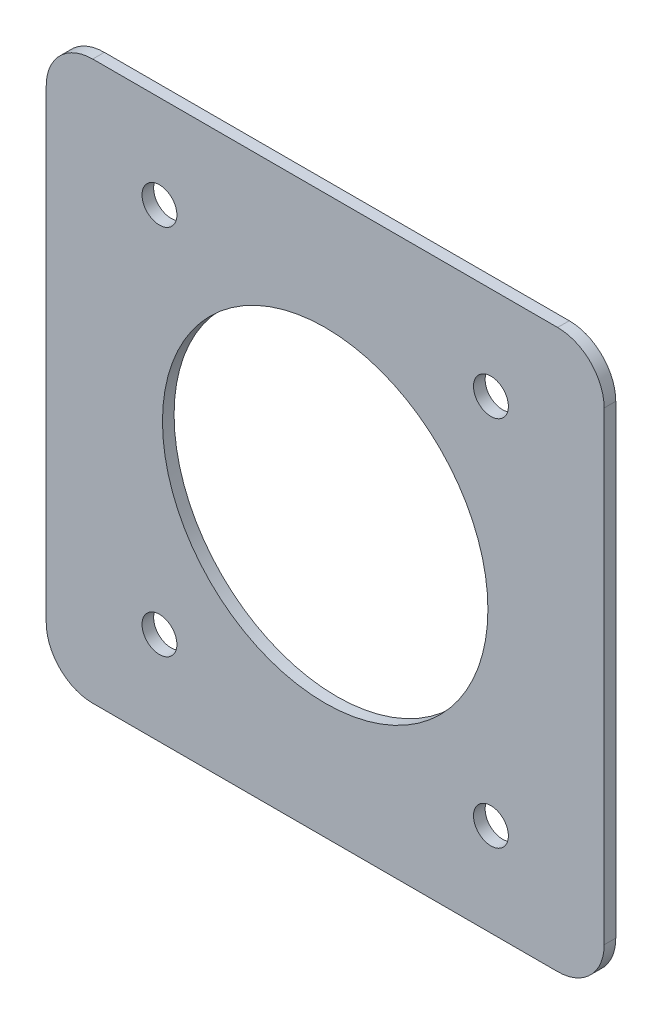
ISO-10303-21;
HEADER;
FILE_DESCRIPTION(('STEP AP214'),'2;1');
FILE_NAME('part.step','',(''),(''),'','','');
FILE_SCHEMA(('AUTOMOTIVE_DESIGN { 1 0 10303 214 1 1 1 1 }'));
ENDSEC;
DATA;
#1=APPLICATION_CONTEXT('core data for automotive mechanical design processes');
#2=APPLICATION_PROTOCOL_DEFINITION('international standard','automotive_design',2000,#1);
#3=PRODUCT_CONTEXT('',#1,'mechanical');
#4=PRODUCT('Part','Part','',(#3));
#5=PRODUCT_RELATED_PRODUCT_CATEGORY('part','',(#4));
#6=PRODUCT_DEFINITION_FORMATION('','',#4);
#7=PRODUCT_DEFINITION_CONTEXT('part definition',#1,'design');
#8=PRODUCT_DEFINITION('design','',#6,#7);
#9=PRODUCT_DEFINITION_SHAPE('','',#8);
#10=(LENGTH_UNIT() NAMED_UNIT(*) SI_UNIT(.MILLI.,.METRE.));
#11=(NAMED_UNIT(*) PLANE_ANGLE_UNIT() SI_UNIT($,.RADIAN.));
#12=(NAMED_UNIT(*) SI_UNIT($,.STERADIAN.) SOLID_ANGLE_UNIT());
#13=UNCERTAINTY_MEASURE_WITH_UNIT(LENGTH_MEASURE(1.E-05),#10,'distance_accuracy_value','');
#14=(GEOMETRIC_REPRESENTATION_CONTEXT(3) GLOBAL_UNCERTAINTY_ASSIGNED_CONTEXT((#13)) GLOBAL_UNIT_ASSIGNED_CONTEXT((#10,
#11,#12)) REPRESENTATION_CONTEXT('',''));
#15=CARTESIAN_POINT('',(0.,0.,0.));
#16=DIRECTION('',(0.,0.,1.));
#17=DIRECTION('',(1.,0.,0.));
#18=AXIS2_PLACEMENT_3D('',#15,#16,#17);
#19=CARTESIAN_POINT('',(-103.997719315894,137.785716341258,3.175));
#20=DIRECTION('',(0.,0.,-1.));
#21=DIRECTION('',(-1.,0.,0.));
#22=AXIS2_PLACEMENT_3D('',#19,#20,#21);
#23=CYLINDRICAL_SURFACE('',#22,12.7);
#24=CARTESIAN_POINT('',(-103.997719315894,137.785716341258,0.));
#25=DIRECTION('',(0.,0.,1.));
#26=DIRECTION('',(1.,0.,0.));
#27=AXIS2_PLACEMENT_3D('',#24,#25,#26);
#28=CIRCLE('',#27,12.7);
#29=CARTESIAN_POINT('',(-103.997719315894,150.485716341258,0.));
#30=VERTEX_POINT('',#29);
#31=CARTESIAN_POINT('',(-91.2977193158941,137.785716341258,0.));
#32=VERTEX_POINT('',#31);
#33=EDGE_CURVE('E141',#30,#32,#28,.F.);
#34=ORIENTED_EDGE('',*,*,#33,.F.);
#35=DIRECTION('',(0.,0.,-1.));
#36=VECTOR('',#35,1.);
#37=CARTESIAN_POINT('',(-103.997719315894,150.485716341258,3.175));
#38=LINE('',#37,#36);
#39=CARTESIAN_POINT('',(-103.997719315894,150.485716341258,3.175));
#40=VERTEX_POINT('',#39);
#41=EDGE_CURVE('E11',#40,#30,#38,.T.);
#42=ORIENTED_EDGE('',*,*,#41,.F.);
#43=CARTESIAN_POINT('',(-103.997719315894,137.785716341258,3.175));
#44=DIRECTION('',(0.,0.,1.));
#45=DIRECTION('',(1.,0.,0.));
#46=AXIS2_PLACEMENT_3D('',#43,#44,#45);
#47=CIRCLE('',#46,12.7);
#48=CARTESIAN_POINT('',(-91.2977193158941,137.785716341258,3.175));
#49=VERTEX_POINT('',#48);
#50=EDGE_CURVE('E171',#40,#49,#47,.F.);
#51=ORIENTED_EDGE('',*,*,#50,.T.);
#52=DIRECTION('',(0.,0.,-1.));
#53=VECTOR('',#52,1.);
#54=CARTESIAN_POINT('',(-91.2977193158941,137.785716341258,3.175));
#55=LINE('',#54,#53);
#56=EDGE_CURVE('E51',#49,#32,#55,.T.);
#57=ORIENTED_EDGE('',*,*,#56,.T.);
#58=EDGE_LOOP('',(#34,#42,#51,#57));
#59=FACE_BOUND('',#58,.T.);
#60=ADVANCED_FACE('F35',(#59),#23,.T.);
#61=CARTESIAN_POINT('',(0.,150.485716341258,3.175));
#62=DIRECTION('',(0.,1.,0.));
#63=DIRECTION('',(0.,0.,1.));
#64=AXIS2_PLACEMENT_3D('',#61,#62,#63);
#65=PLANE('',#64);
#66=DIRECTION('',(1.,0.,0.));
#67=VECTOR('',#66,1.);
#68=CARTESIAN_POINT('',(0.,150.485716341258,0.));
#69=LINE('',#68,#67);
#70=CARTESIAN_POINT('',(-230.997719315894,150.485716341258,0.));
#71=VERTEX_POINT('',#70);
#72=EDGE_CURVE('E143',#71,#30,#69,.T.);
#73=ORIENTED_EDGE('',*,*,#72,.F.);
#74=DIRECTION('',(0.,0.,-1.));
#75=VECTOR('',#74,1.);
#76=CARTESIAN_POINT('',(-230.997719315894,150.485716341258,3.175));
#77=LINE('',#76,#75);
#78=CARTESIAN_POINT('',(-230.997719315894,150.485716341258,3.175));
#79=VERTEX_POINT('',#78);
#80=EDGE_CURVE('E43',#79,#71,#77,.T.);
#81=ORIENTED_EDGE('',*,*,#80,.F.);
#82=DIRECTION('',(1.,0.,0.));
#83=VECTOR('',#82,1.);
#84=CARTESIAN_POINT('',(0.,150.485716341258,3.175));
#85=LINE('',#84,#83);
#86=EDGE_CURVE('E196',#79,#40,#85,.T.);
#87=ORIENTED_EDGE('',*,*,#86,.T.);
#88=ORIENTED_EDGE('',*,*,#41,.T.);
#89=EDGE_LOOP('',(#73,#81,#87,#88));
#90=FACE_BOUND('',#89,.T.);
#91=ADVANCED_FACE('F195',(#90),#65,.T.);
#92=CARTESIAN_POINT('',(-230.997719315894,137.785716341258,3.175));
#93=DIRECTION('',(0.,0.,-1.));
#94=DIRECTION('',(-1.,0.,0.));
#95=AXIS2_PLACEMENT_3D('',#92,#93,#94);
#96=CYLINDRICAL_SURFACE('',#95,12.7);
#97=CARTESIAN_POINT('',(-230.997719315894,137.785716341258,0.));
#98=DIRECTION('',(0.,0.,1.));
#99=DIRECTION('',(1.,0.,0.));
#100=AXIS2_PLACEMENT_3D('',#97,#98,#99);
#101=CIRCLE('',#100,12.7);
#102=CARTESIAN_POINT('',(-243.697719315894,137.785716341258,0.));
#103=VERTEX_POINT('',#102);
#104=EDGE_CURVE('E147',#71,#103,#101,.T.);
#105=ORIENTED_EDGE('',*,*,#104,.T.);
#106=DIRECTION('',(0.,0.,-1.));
#107=VECTOR('',#106,1.);
#108=CARTESIAN_POINT('',(-243.697719315894,137.785716341258,3.175));
#109=LINE('',#108,#107);
#110=CARTESIAN_POINT('',(-243.697719315894,137.785716341258,3.175));
#111=VERTEX_POINT('',#110);
#112=EDGE_CURVE('E178',#111,#103,#109,.T.);
#113=ORIENTED_EDGE('',*,*,#112,.F.);
#114=CARTESIAN_POINT('',(-230.997719315894,137.785716341258,3.175));
#115=DIRECTION('',(0.,0.,1.));
#116=DIRECTION('',(1.,0.,0.));
#117=AXIS2_PLACEMENT_3D('',#114,#115,#116);
#118=CIRCLE('',#117,12.7);
#119=EDGE_CURVE('E185',#79,#111,#118,.T.);
#120=ORIENTED_EDGE('',*,*,#119,.F.);
#121=ORIENTED_EDGE('',*,*,#80,.T.);
#122=EDGE_LOOP('',(#105,#113,#120,#121));
#123=FACE_BOUND('',#122,.T.);
#124=ADVANCED_FACE('F183',(#123),#96,.T.);
#125=CARTESIAN_POINT('',(-243.697719315894,0.,3.175));
#126=DIRECTION('',(1.,0.,0.));
#127=DIRECTION('',(0.,1.,0.));
#128=AXIS2_PLACEMENT_3D('',#125,#126,#127);
#129=PLANE('',#128);
#130=DIRECTION('',(0.,-1.,0.));
#131=VECTOR('',#130,1.);
#132=CARTESIAN_POINT('',(-243.697719315894,0.,0.));
#133=LINE('',#132,#131);
#134=CARTESIAN_POINT('',(-243.697719315894,10.7857163412583,0.));
#135=VERTEX_POINT('',#134);
#136=EDGE_CURVE('E149',#103,#135,#133,.T.);
#137=ORIENTED_EDGE('',*,*,#136,.T.);
#138=DIRECTION('',(0.,0.,-1.));
#139=VECTOR('',#138,1.);
#140=CARTESIAN_POINT('',(-243.697719315894,10.7857163412583,3.175));
#141=LINE('',#140,#139);
#142=CARTESIAN_POINT('',(-243.697719315894,10.7857163412583,3.175));
#143=VERTEX_POINT('',#142);
#144=EDGE_CURVE('E175',#143,#135,#141,.T.);
#145=ORIENTED_EDGE('',*,*,#144,.F.);
#146=DIRECTION('',(0.,-1.,0.));
#147=VECTOR('',#146,1.);
#148=CARTESIAN_POINT('',(-243.697719315894,0.,3.175));
#149=LINE('',#148,#147);
#150=EDGE_CURVE('E267',#111,#143,#149,.T.);
#151=ORIENTED_EDGE('',*,*,#150,.F.);
#152=ORIENTED_EDGE('',*,*,#112,.T.);
#153=EDGE_LOOP('',(#137,#145,#151,#152));
#154=FACE_BOUND('',#153,.T.);
#155=ADVANCED_FACE('F219',(#154),#129,.F.);
#156=CARTESIAN_POINT('',(-230.997719315894,10.7857163412582,3.175));
#157=DIRECTION('',(0.,0.,-1.));
#158=DIRECTION('',(-1.,0.,0.));
#159=AXIS2_PLACEMENT_3D('',#156,#157,#158);
#160=CYLINDRICAL_SURFACE('',#159,12.7);
#161=CARTESIAN_POINT('',(-230.997719315894,10.7857163412582,0.));
#162=DIRECTION('',(0.,0.,1.));
#163=DIRECTION('',(1.,0.,0.));
#164=AXIS2_PLACEMENT_3D('',#161,#162,#163);
#165=CIRCLE('',#164,12.7);
#166=CARTESIAN_POINT('',(-230.997719315894,-1.91428365874183,0.));
#167=VERTEX_POINT('',#166);
#168=EDGE_CURVE('E151',#135,#167,#165,.T.);
#169=ORIENTED_EDGE('',*,*,#168,.T.);
#170=DIRECTION('',(0.,0.,-1.));
#171=VECTOR('',#170,1.);
#172=CARTESIAN_POINT('',(-230.997719315894,-1.91428365874183,3.175));
#173=LINE('',#172,#171);
#174=CARTESIAN_POINT('',(-230.997719315894,-1.91428365874183,3.175));
#175=VERTEX_POINT('',#174);
#176=EDGE_CURVE('E121',#175,#167,#173,.T.);
#177=ORIENTED_EDGE('',*,*,#176,.F.);
#178=CARTESIAN_POINT('',(-230.997719315894,10.7857163412582,3.175));
#179=DIRECTION('',(0.,0.,1.));
#180=DIRECTION('',(1.,0.,0.));
#181=AXIS2_PLACEMENT_3D('',#178,#179,#180);
#182=CIRCLE('',#181,12.7);
#183=EDGE_CURVE('E109',#143,#175,#182,.T.);
#184=ORIENTED_EDGE('',*,*,#183,.F.);
#185=ORIENTED_EDGE('',*,*,#144,.T.);
#186=EDGE_LOOP('',(#169,#177,#184,#185));
#187=FACE_BOUND('',#186,.T.);
#188=ADVANCED_FACE('F224',(#187),#160,.T.);
#189=CARTESIAN_POINT('',(0.,-1.9142836587418,3.175));
#190=DIRECTION('',(0.,1.,0.));
#191=DIRECTION('',(-1.,0.,0.));
#192=AXIS2_PLACEMENT_3D('',#189,#190,#191);
#193=PLANE('',#192);
#194=DIRECTION('',(1.,0.,0.));
#195=VECTOR('',#194,1.);
#196=CARTESIAN_POINT('',(0.,-1.9142836587418,0.));
#197=LINE('',#196,#195);
#198=CARTESIAN_POINT('',(-103.997719315894,-1.91428365874181,0.));
#199=VERTEX_POINT('',#198);
#200=EDGE_CURVE('E118',#167,#199,#197,.T.);
#201=ORIENTED_EDGE('',*,*,#200,.T.);
#202=DIRECTION('',(0.,0.,-1.));
#203=VECTOR('',#202,1.);
#204=CARTESIAN_POINT('',(-103.997719315894,-1.91428365874181,3.175));
#205=LINE('',#204,#203);
#206=CARTESIAN_POINT('',(-103.997719315894,-1.91428365874181,3.175));
#207=VERTEX_POINT('',#206);
#208=EDGE_CURVE('E115',#207,#199,#205,.T.);
#209=ORIENTED_EDGE('',*,*,#208,.F.);
#210=DIRECTION('',(1.,0.,0.));
#211=VECTOR('',#210,1.);
#212=CARTESIAN_POINT('',(0.,-1.9142836587418,3.175));
#213=LINE('',#212,#211);
#214=EDGE_CURVE('E101',#175,#207,#213,.T.);
#215=ORIENTED_EDGE('',*,*,#214,.F.);
#216=ORIENTED_EDGE('',*,*,#176,.T.);
#217=EDGE_LOOP('',(#201,#209,#215,#216));
#218=FACE_BOUND('',#217,.T.);
#219=ADVANCED_FACE('F116',(#218),#193,.F.);
#220=CARTESIAN_POINT('',(-103.997719315894,10.7857163412582,3.175));
#221=DIRECTION('',(0.,0.,-1.));
#222=DIRECTION('',(-1.,0.,0.));
#223=AXIS2_PLACEMENT_3D('',#220,#221,#222);
#224=CYLINDRICAL_SURFACE('',#223,12.7);
#225=CARTESIAN_POINT('',(-103.997719315894,10.7857163412582,0.));
#226=DIRECTION('',(0.,0.,1.));
#227=DIRECTION('',(1.,0.,0.));
#228=AXIS2_PLACEMENT_3D('',#225,#226,#227);
#229=CIRCLE('',#228,12.7);
#230=CARTESIAN_POINT('',(-91.297719315894,10.7857163412583,0.));
#231=VERTEX_POINT('',#230);
#232=EDGE_CURVE('E154',#199,#231,#229,.T.);
#233=ORIENTED_EDGE('',*,*,#232,.T.);
#234=DIRECTION('',(0.,0.,-1.));
#235=VECTOR('',#234,1.);
#236=CARTESIAN_POINT('',(-91.297719315894,10.7857163412583,3.175));
#237=LINE('',#236,#235);
#238=CARTESIAN_POINT('',(-91.297719315894,10.7857163412583,3.175));
#239=VERTEX_POINT('',#238);
#240=EDGE_CURVE('E77',#239,#231,#237,.T.);
#241=ORIENTED_EDGE('',*,*,#240,.F.);
#242=CARTESIAN_POINT('',(-103.997719315894,10.7857163412582,3.175));
#243=DIRECTION('',(0.,0.,1.));
#244=DIRECTION('',(1.,0.,0.));
#245=AXIS2_PLACEMENT_3D('',#242,#243,#244);
#246=CIRCLE('',#245,12.7);
#247=EDGE_CURVE('E107',#207,#239,#246,.T.);
#248=ORIENTED_EDGE('',*,*,#247,.F.);
#249=ORIENTED_EDGE('',*,*,#208,.T.);
#250=EDGE_LOOP('',(#233,#241,#248,#249));
#251=FACE_BOUND('',#250,.T.);
#252=ADVANCED_FACE('F123',(#251),#224,.T.);
#253=CARTESIAN_POINT('',(-212.773219315894,125.085716341257,3.175));
#254=DIRECTION('',(0.,0.,-1.));
#255=DIRECTION('',(-1.,0.,0.));
#256=AXIS2_PLACEMENT_3D('',#253,#254,#255);
#257=CYLINDRICAL_SURFACE('',#256,4.76249999999992);
#258=CARTESIAN_POINT('',(-212.773219315894,125.085716341257,3.175));
#259=DIRECTION('',(0.,0.,1.));
#260=DIRECTION('',(1.,0.,0.));
#261=AXIS2_PLACEMENT_3D('',#258,#259,#260);
#262=CIRCLE('',#261,4.76249999999992);
#263=CARTESIAN_POINT('',(-208.010719315894,125.085716341257,3.175));
#264=VERTEX_POINT('',#263);
#265=EDGE_CURVE('E135',#264,#264,#262,.T.);
#266=ORIENTED_EDGE('',*,*,#265,.T.);
#267=EDGE_LOOP('',(#266));
#268=FACE_BOUND('',#267,.T.);
#269=CARTESIAN_POINT('',(-212.773219315894,125.085716341257,0.));
#270=DIRECTION('',(0.,0.,1.));
#271=DIRECTION('',(1.,0.,0.));
#272=AXIS2_PLACEMENT_3D('',#269,#270,#271);
#273=CIRCLE('',#272,4.76249999999992);
#274=CARTESIAN_POINT('',(-208.010719315894,125.085716341257,0.));
#275=VERTEX_POINT('',#274);
#276=EDGE_CURVE('E165',#275,#275,#273,.T.);
#277=ORIENTED_EDGE('',*,*,#276,.F.);
#278=EDGE_LOOP('',(#277));
#279=FACE_BOUND('',#278,.T.);
#280=ADVANCED_FACE('F231',(#268,#279),#257,.F.);
#281=CARTESIAN_POINT('',(-212.773219315894,23.4857163412565,3.175));
#282=DIRECTION('',(0.,0.,-1.));
#283=DIRECTION('',(-1.,0.,0.));
#284=AXIS2_PLACEMENT_3D('',#281,#282,#283);
#285=CYLINDRICAL_SURFACE('',#284,4.76249999999992);
#286=CARTESIAN_POINT('',(-212.773219315894,23.4857163412565,3.175));
#287=DIRECTION('',(0.,0.,1.));
#288=DIRECTION('',(1.,0.,0.));
#289=AXIS2_PLACEMENT_3D('',#286,#287,#288);
#290=CIRCLE('',#289,4.76249999999992);
#291=CARTESIAN_POINT('',(-208.010719315894,23.4857163412565,3.175));
#292=VERTEX_POINT('',#291);
#293=EDGE_CURVE('E132',#292,#292,#290,.T.);
#294=ORIENTED_EDGE('',*,*,#293,.T.);
#295=EDGE_LOOP('',(#294));
#296=FACE_BOUND('',#295,.T.);
#297=CARTESIAN_POINT('',(-212.773219315894,23.4857163412565,0.));
#298=DIRECTION('',(0.,0.,1.));
#299=DIRECTION('',(1.,0.,0.));
#300=AXIS2_PLACEMENT_3D('',#297,#298,#299);
#301=CIRCLE('',#300,4.76249999999992);
#302=CARTESIAN_POINT('',(-208.010719315894,23.4857163412565,0.));
#303=VERTEX_POINT('',#302);
#304=EDGE_CURVE('E162',#303,#303,#301,.T.);
#305=ORIENTED_EDGE('',*,*,#304,.F.);
#306=EDGE_LOOP('',(#305));
#307=FACE_BOUND('',#306,.T.);
#308=ADVANCED_FACE('F208',(#296,#307),#285,.F.);
#309=CARTESIAN_POINT('',(-122.222219315894,23.4857163412565,3.175));
#310=DIRECTION('',(0.,0.,-1.));
#311=DIRECTION('',(-1.,0.,0.));
#312=AXIS2_PLACEMENT_3D('',#309,#310,#311);
#313=CYLINDRICAL_SURFACE('',#312,4.76249999999992);
#314=CARTESIAN_POINT('',(-122.222219315894,23.4857163412565,3.175));
#315=DIRECTION('',(0.,0.,1.));
#316=DIRECTION('',(1.,0.,0.));
#317=AXIS2_PLACEMENT_3D('',#314,#315,#316);
#318=CIRCLE('',#317,4.76249999999992);
#319=CARTESIAN_POINT('',(-117.459719315894,23.4857163412565,3.175));
#320=VERTEX_POINT('',#319);
#321=EDGE_CURVE('E126',#320,#320,#318,.T.);
#322=ORIENTED_EDGE('',*,*,#321,.T.);
#323=EDGE_LOOP('',(#322));
#324=FACE_BOUND('',#323,.T.);
#325=CARTESIAN_POINT('',(-122.222219315894,23.4857163412565,0.));
#326=DIRECTION('',(0.,0.,1.));
#327=DIRECTION('',(1.,0.,0.));
#328=AXIS2_PLACEMENT_3D('',#325,#326,#327);
#329=CIRCLE('',#328,4.76249999999992);
#330=CARTESIAN_POINT('',(-117.459719315894,23.4857163412565,0.));
#331=VERTEX_POINT('',#330);
#332=EDGE_CURVE('E159',#331,#331,#329,.T.);
#333=ORIENTED_EDGE('',*,*,#332,.F.);
#334=EDGE_LOOP('',(#333));
#335=FACE_BOUND('',#334,.T.);
#336=ADVANCED_FACE('F200',(#324,#335),#313,.F.);
#337=CARTESIAN_POINT('',(-91.297719315894,0.,3.175));
#338=DIRECTION('',(1.,0.,0.));
#339=DIRECTION('',(0.,1.,0.));
#340=AXIS2_PLACEMENT_3D('',#337,#338,#339);
#341=PLANE('',#340);
#342=DIRECTION('',(0.,-1.,0.));
#343=VECTOR('',#342,1.);
#344=CARTESIAN_POINT('',(-91.297719315894,0.,0.));
#345=LINE('',#344,#343);
#346=EDGE_CURVE('E156',#32,#231,#345,.T.);
#347=ORIENTED_EDGE('',*,*,#346,.F.);
#348=ORIENTED_EDGE('',*,*,#56,.F.);
#349=DIRECTION('',(0.,-1.,0.));
#350=VECTOR('',#349,1.);
#351=CARTESIAN_POINT('',(-91.297719315894,0.,3.175));
#352=LINE('',#351,#350);
#353=EDGE_CURVE('E124',#49,#239,#352,.T.);
#354=ORIENTED_EDGE('',*,*,#353,.T.);
#355=ORIENTED_EDGE('',*,*,#240,.T.);
#356=EDGE_LOOP('',(#347,#348,#354,#355));
#357=FACE_BOUND('',#356,.T.);
#358=ADVANCED_FACE('F197',(#357),#341,.T.);
#359=CARTESIAN_POINT('',(-122.222219315894,125.085716341257,3.175));
#360=DIRECTION('',(0.,0.,-1.));
#361=DIRECTION('',(-1.,0.,0.));
#362=AXIS2_PLACEMENT_3D('',#359,#360,#361);
#363=CYLINDRICAL_SURFACE('',#362,4.76249999999992);
#364=CARTESIAN_POINT('',(-122.222219315894,125.085716341257,3.175));
#365=DIRECTION('',(0.,0.,1.));
#366=DIRECTION('',(1.,0.,0.));
#367=AXIS2_PLACEMENT_3D('',#364,#365,#366);
#368=CIRCLE('',#367,4.76249999999992);
#369=CARTESIAN_POINT('',(-117.459719315894,125.085716341257,3.175));
#370=VERTEX_POINT('',#369);
#371=EDGE_CURVE('E138',#370,#370,#368,.T.);
#372=ORIENTED_EDGE('',*,*,#371,.T.);
#373=EDGE_LOOP('',(#372));
#374=FACE_BOUND('',#373,.T.);
#375=CARTESIAN_POINT('',(-122.222219315894,125.085716341257,0.));
#376=DIRECTION('',(0.,0.,1.));
#377=DIRECTION('',(1.,0.,0.));
#378=AXIS2_PLACEMENT_3D('',#375,#376,#377);
#379=CIRCLE('',#378,4.76249999999992);
#380=CARTESIAN_POINT('',(-117.459719315894,125.085716341257,0.));
#381=VERTEX_POINT('',#380);
#382=EDGE_CURVE('E168',#381,#381,#379,.T.);
#383=ORIENTED_EDGE('',*,*,#382,.F.);
#384=EDGE_LOOP('',(#383));
#385=FACE_BOUND('',#384,.T.);
#386=ADVANCED_FACE('F199',(#374,#385),#363,.F.);
#387=CARTESIAN_POINT('',(0.,0.,3.175));
#388=DIRECTION('',(0.,0.,1.));
#389=DIRECTION('',(1.,0.,0.));
#390=AXIS2_PLACEMENT_3D('',#387,#388,#389);
#391=PLANE('',#390);
#392=CARTESIAN_POINT('',(-167.497719315894,74.2857163412582,3.175));
#393=DIRECTION('',(0.,0.,1.));
#394=DIRECTION('',(1.,0.,0.));
#395=AXIS2_PLACEMENT_3D('',#392,#393,#394);
#396=CIRCLE('',#395,44.45);
#397=CARTESIAN_POINT('',(-123.047719315894,74.2857163412582,3.175));
#398=VERTEX_POINT('',#397);
#399=EDGE_CURVE('E260',#398,#398,#396,.T.);
#400=ORIENTED_EDGE('',*,*,#399,.F.);
#401=EDGE_LOOP('',(#400));
#402=FACE_BOUND('',#401,.T.);
#403=ORIENTED_EDGE('',*,*,#50,.F.);
#404=ORIENTED_EDGE('',*,*,#86,.F.);
#405=ORIENTED_EDGE('',*,*,#119,.T.);
#406=ORIENTED_EDGE('',*,*,#150,.T.);
#407=ORIENTED_EDGE('',*,*,#183,.T.);
#408=ORIENTED_EDGE('',*,*,#214,.T.);
#409=ORIENTED_EDGE('',*,*,#247,.T.);
#410=ORIENTED_EDGE('',*,*,#353,.F.);
#411=EDGE_LOOP('',(#403,#404,#405,#406,#407,#408,#409,#410));
#412=FACE_BOUND('',#411,.T.);
#413=ORIENTED_EDGE('',*,*,#321,.F.);
#414=EDGE_LOOP('',(#413));
#415=FACE_BOUND('',#414,.T.);
#416=ORIENTED_EDGE('',*,*,#293,.F.);
#417=EDGE_LOOP('',(#416));
#418=FACE_BOUND('',#417,.T.);
#419=ORIENTED_EDGE('',*,*,#265,.F.);
#420=EDGE_LOOP('',(#419));
#421=FACE_BOUND('',#420,.T.);
#422=ORIENTED_EDGE('',*,*,#371,.F.);
#423=EDGE_LOOP('',(#422));
#424=FACE_BOUND('',#423,.T.);
#425=ADVANCED_FACE('F103',(#402,#412,#415,#418,#421,#424),#391,.T.);
#426=CARTESIAN_POINT('',(0.,0.,0.));
#427=DIRECTION('',(0.,0.,1.));
#428=DIRECTION('',(1.,0.,0.));
#429=AXIS2_PLACEMENT_3D('',#426,#427,#428);
#430=PLANE('',#429);
#431=CARTESIAN_POINT('',(-167.497719315894,74.2857163412582,0.));
#432=DIRECTION('',(0.,0.,1.));
#433=DIRECTION('',(1.,0.,0.));
#434=AXIS2_PLACEMENT_3D('',#431,#432,#433);
#435=CIRCLE('',#434,44.45);
#436=CARTESIAN_POINT('',(-123.047719315894,74.2857163412582,0.));
#437=VERTEX_POINT('',#436);
#438=EDGE_CURVE('E144',#437,#437,#435,.T.);
#439=ORIENTED_EDGE('',*,*,#438,.T.);
#440=EDGE_LOOP('',(#439));
#441=FACE_BOUND('',#440,.T.);
#442=ORIENTED_EDGE('',*,*,#33,.T.);
#443=ORIENTED_EDGE('',*,*,#346,.T.);
#444=ORIENTED_EDGE('',*,*,#232,.F.);
#445=ORIENTED_EDGE('',*,*,#200,.F.);
#446=ORIENTED_EDGE('',*,*,#168,.F.);
#447=ORIENTED_EDGE('',*,*,#136,.F.);
#448=ORIENTED_EDGE('',*,*,#104,.F.);
#449=ORIENTED_EDGE('',*,*,#72,.T.);
#450=EDGE_LOOP('',(#442,#443,#444,#445,#446,#447,#448,#449));
#451=FACE_BOUND('',#450,.T.);
#452=ORIENTED_EDGE('',*,*,#332,.T.);
#453=EDGE_LOOP('',(#452));
#454=FACE_BOUND('',#453,.T.);
#455=ORIENTED_EDGE('',*,*,#304,.T.);
#456=EDGE_LOOP('',(#455));
#457=FACE_BOUND('',#456,.T.);
#458=ORIENTED_EDGE('',*,*,#276,.T.);
#459=EDGE_LOOP('',(#458));
#460=FACE_BOUND('',#459,.T.);
#461=ORIENTED_EDGE('',*,*,#382,.T.);
#462=EDGE_LOOP('',(#461));
#463=FACE_BOUND('',#462,.T.);
#464=ADVANCED_FACE('F192',(#441,#451,#454,#457,#460,#463),#430,.F.);
#465=CARTESIAN_POINT('',(-167.497719315894,74.2857163412582,0.));
#466=DIRECTION('',(0.,0.,1.));
#467=DIRECTION('',(1.,0.,0.));
#468=AXIS2_PLACEMENT_3D('',#465,#466,#467);
#469=CYLINDRICAL_SURFACE('',#468,44.45);
#470=ORIENTED_EDGE('',*,*,#438,.F.);
#471=EDGE_LOOP('',(#470));
#472=FACE_BOUND('',#471,.T.);
#473=ORIENTED_EDGE('',*,*,#399,.T.);
#474=EDGE_LOOP('',(#473));
#475=FACE_BOUND('',#474,.T.);
#476=ADVANCED_FACE('F246',(#472,#475),#469,.F.);
#477=CLOSED_SHELL('',(#60,#91,#124,#155,#188,#219,#252,#280,#308,#336,#358,#386,#425,#464,#476));
#478=MANIFOLD_SOLID_BREP('B2',#477);
#479=ADVANCED_BREP_SHAPE_REPRESENTATION('',(#18,#478),#14);
#480=SHAPE_DEFINITION_REPRESENTATION(#9,#479);
ENDSEC;
END-ISO-10303-21;
